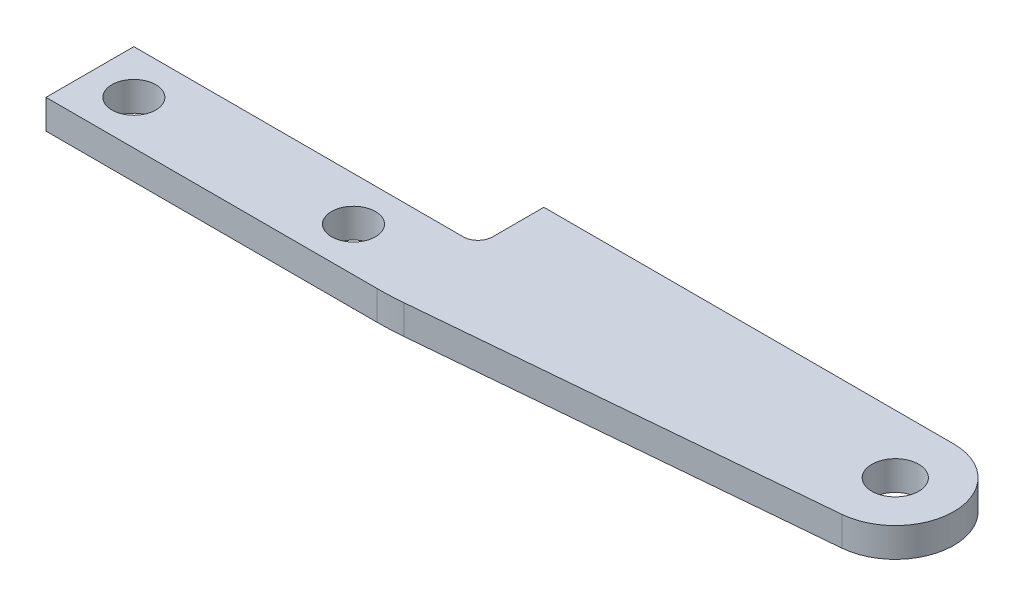
ISO-10303-21;
HEADER;
FILE_DESCRIPTION(('STEP AP214'),'2;1');
FILE_NAME('part.step','',(''),(''),'','','');
FILE_SCHEMA(('AUTOMOTIVE_DESIGN { 1 0 10303 214 1 1 1 1 }'));
ENDSEC;
DATA;
#1=APPLICATION_CONTEXT('core data for automotive mechanical design processes');
#2=APPLICATION_PROTOCOL_DEFINITION('international standard','automotive_design',2000,#1);
#3=PRODUCT_CONTEXT('',#1,'mechanical');
#4=PRODUCT('Part','Part','',(#3));
#5=PRODUCT_RELATED_PRODUCT_CATEGORY('part','',(#4));
#6=PRODUCT_DEFINITION_FORMATION('','',#4);
#7=PRODUCT_DEFINITION_CONTEXT('part definition',#1,'design');
#8=PRODUCT_DEFINITION('design','',#6,#7);
#9=PRODUCT_DEFINITION_SHAPE('','',#8);
#10=(LENGTH_UNIT() NAMED_UNIT(*) SI_UNIT(.MILLI.,.METRE.));
#11=(NAMED_UNIT(*) PLANE_ANGLE_UNIT() SI_UNIT($,.RADIAN.));
#12=(NAMED_UNIT(*) SI_UNIT($,.STERADIAN.) SOLID_ANGLE_UNIT());
#13=UNCERTAINTY_MEASURE_WITH_UNIT(LENGTH_MEASURE(1.E-05),#10,'distance_accuracy_value','');
#14=(GEOMETRIC_REPRESENTATION_CONTEXT(3) GLOBAL_UNCERTAINTY_ASSIGNED_CONTEXT((#13)) GLOBAL_UNIT_ASSIGNED_CONTEXT((#10,
#11,#12)) REPRESENTATION_CONTEXT('',''));
#15=CARTESIAN_POINT('',(0.,0.,0.));
#16=DIRECTION('',(0.,0.,1.));
#17=DIRECTION('',(1.,0.,0.));
#18=AXIS2_PLACEMENT_3D('',#15,#16,#17);
#19=CARTESIAN_POINT('',(48.5,2.,-3.5));
#20=DIRECTION('',(0.,1.,0.));
#21=DIRECTION('',(0.,0.,1.));
#22=AXIS2_PLACEMENT_3D('',#19,#20,#21);
#23=PLANE('',#22);
#24=CARTESIAN_POINT('',(0.,2.,0.));
#25=DIRECTION('',(0.,1.,0.));
#26=DIRECTION('',(0.,0.,-1.));
#27=AXIS2_PLACEMENT_3D('',#24,#25,#26);
#28=CIRCLE('',#27,1.5);
#29=CARTESIAN_POINT('',(0.,2.,-1.5));
#30=VERTEX_POINT('',#29);
#31=EDGE_CURVE('E202',#30,#30,#28,.T.);
#32=ORIENTED_EDGE('',*,*,#31,.F.);
#33=EDGE_LOOP('',(#32));
#34=FACE_BOUND('',#33,.T.);
#35=DIRECTION('',(1.,0.,0.));
#36=VECTOR('',#35,1.);
#37=CARTESIAN_POINT('',(-3.,2.,3.));
#38=LINE('',#37,#36);
#39=CARTESIAN_POINT('',(-3.,2.,3.));
#40=VERTEX_POINT('',#39);
#41=CARTESIAN_POINT('',(19.6144939905132,2.,3.));
#42=VERTEX_POINT('',#41);
#43=EDGE_CURVE('E157',#40,#42,#38,.T.);
#44=ORIENTED_EDGE('',*,*,#43,.T.);
#45=CARTESIAN_POINT('',(19.6144939905132,2.,-17.));
#46=DIRECTION('',(0.,1.,0.));
#47=DIRECTION('',(0.,0.,1.));
#48=AXIS2_PLACEMENT_3D('',#45,#46,#47);
#49=CIRCLE('',#48,20.);
#50=CARTESIAN_POINT('',(21.3820410829761,2.,2.92174132137866));
#51=VERTEX_POINT('',#50);
#52=EDGE_CURVE('E11',#42,#51,#49,.T.);
#53=ORIENTED_EDGE('',*,*,#52,.T.);
#54=DIRECTION('',(0.996087066068933,0.,-0.0883773546231454));
#55=VECTOR('',#54,1.);
#56=CARTESIAN_POINT('',(48.8535094184926,2.,0.484348264275727));
#57=LINE('',#56,#55);
#58=CARTESIAN_POINT('',(48.8535094184926,2.,0.484348264275728));
#59=VERTEX_POINT('',#58);
#60=EDGE_CURVE('E104',#51,#59,#57,.T.);
#61=ORIENTED_EDGE('',*,*,#60,.T.);
#62=CARTESIAN_POINT('',(48.5,2.,-3.5));
#63=DIRECTION('',(0.,1.,0.));
#64=DIRECTION('',(0.,0.,1.));
#65=AXIS2_PLACEMENT_3D('',#62,#63,#64);
#66=CIRCLE('',#65,4.);
#67=CARTESIAN_POINT('',(48.5,2.,-7.5));
#68=VERTEX_POINT('',#67);
#69=EDGE_CURVE('E107',#59,#68,#66,.T.);
#70=ORIENTED_EDGE('',*,*,#69,.T.);
#71=DIRECTION('',(-1.,0.,0.));
#72=VECTOR('',#71,1.);
#73=CARTESIAN_POINT('',(48.5,2.,-7.5));
#74=LINE('',#73,#72);
#75=CARTESIAN_POINT('',(20.5,2.,-7.5));
#76=VERTEX_POINT('',#75);
#77=EDGE_CURVE('E123',#68,#76,#74,.T.);
#78=ORIENTED_EDGE('',*,*,#77,.T.);
#79=DIRECTION('',(0.,0.,1.));
#80=VECTOR('',#79,1.);
#81=CARTESIAN_POINT('',(20.5,2.,-7.5));
#82=LINE('',#81,#80);
#83=CARTESIAN_POINT('',(20.5,2.,-4.));
#84=VERTEX_POINT('',#83);
#85=EDGE_CURVE('E182',#76,#84,#82,.T.);
#86=ORIENTED_EDGE('',*,*,#85,.T.);
#87=CARTESIAN_POINT('',(19.5,2.,-4.));
#88=DIRECTION('',(0.,1.,0.));
#89=DIRECTION('',(0.,0.,1.));
#90=AXIS2_PLACEMENT_3D('',#87,#88,#89);
#91=CIRCLE('',#90,1.);
#92=CARTESIAN_POINT('',(19.5,2.,-3.));
#93=VERTEX_POINT('',#92);
#94=EDGE_CURVE('E140',#84,#93,#91,.F.);
#95=ORIENTED_EDGE('',*,*,#94,.T.);
#96=DIRECTION('',(-1.,0.,0.));
#97=VECTOR('',#96,1.);
#98=CARTESIAN_POINT('',(20.5,2.,-3.));
#99=LINE('',#98,#97);
#100=CARTESIAN_POINT('',(-3.,2.,-3.));
#101=VERTEX_POINT('',#100);
#102=EDGE_CURVE('E194',#93,#101,#99,.T.);
#103=ORIENTED_EDGE('',*,*,#102,.T.);
#104=DIRECTION('',(0.,0.,1.));
#105=VECTOR('',#104,1.);
#106=CARTESIAN_POINT('',(-3.,2.,-3.));
#107=LINE('',#106,#105);
#108=EDGE_CURVE('E196',#101,#40,#107,.T.);
#109=ORIENTED_EDGE('',*,*,#108,.T.);
#110=EDGE_LOOP('',(#44,#53,#61,#70,#78,#86,#95,#103,#109));
#111=FACE_BOUND('',#110,.T.);
#112=CARTESIAN_POINT('',(48.5,2.,-3.5));
#113=DIRECTION('',(0.,1.,0.));
#114=DIRECTION('',(0.,0.,1.));
#115=AXIS2_PLACEMENT_3D('',#112,#113,#114);
#116=CIRCLE('',#115,1.6);
#117=CARTESIAN_POINT('',(48.5,2.,-1.90000000000001));
#118=VERTEX_POINT('',#117);
#119=EDGE_CURVE('E149',#118,#118,#116,.T.);
#120=ORIENTED_EDGE('',*,*,#119,.F.);
#121=EDGE_LOOP('',(#120));
#122=FACE_BOUND('',#121,.T.);
#123=CARTESIAN_POINT('',(15.,2.,0.));
#124=DIRECTION('',(0.,1.,0.));
#125=DIRECTION('',(0.,0.,-1.));
#126=AXIS2_PLACEMENT_3D('',#123,#124,#125);
#127=CIRCLE('',#126,1.5);
#128=CARTESIAN_POINT('',(15.,2.,-1.50000000000001));
#129=VERTEX_POINT('',#128);
#130=EDGE_CURVE('E207',#129,#129,#127,.T.);
#131=ORIENTED_EDGE('',*,*,#130,.F.);
#132=EDGE_LOOP('',(#131));
#133=FACE_BOUND('',#132,.T.);
#134=ADVANCED_FACE('F34',(#34,#111,#122,#133),#23,.T.);
#135=CARTESIAN_POINT('',(48.5,0.,-3.5));
#136=DIRECTION('',(0.,1.,0.));
#137=DIRECTION('',(0.,0.,1.));
#138=AXIS2_PLACEMENT_3D('',#135,#136,#137);
#139=PLANE('',#138);
#140=DIRECTION('',(0.996087066068933,0.,-0.0883773546231454));
#141=VECTOR('',#140,1.);
#142=CARTESIAN_POINT('',(48.8535094184926,0.,0.484348264275727));
#143=LINE('',#142,#141);
#144=CARTESIAN_POINT('',(21.3820410829761,0.,2.92174132137866));
#145=VERTEX_POINT('',#144);
#146=CARTESIAN_POINT('',(48.8535094184926,0.,0.484348264275728));
#147=VERTEX_POINT('',#146);
#148=EDGE_CURVE('E126',#145,#147,#143,.T.);
#149=ORIENTED_EDGE('',*,*,#148,.F.);
#150=CARTESIAN_POINT('',(19.6144939905132,0.,-17.));
#151=DIRECTION('',(0.,1.,0.));
#152=DIRECTION('',(0.,0.,1.));
#153=AXIS2_PLACEMENT_3D('',#150,#151,#152);
#154=CIRCLE('',#153,20.);
#155=CARTESIAN_POINT('',(19.6144939905132,0.,3.));
#156=VERTEX_POINT('',#155);
#157=EDGE_CURVE('E56',#145,#156,#154,.F.);
#158=ORIENTED_EDGE('',*,*,#157,.T.);
#159=DIRECTION('',(1.,0.,0.));
#160=VECTOR('',#159,1.);
#161=CARTESIAN_POINT('',(-3.,0.,3.));
#162=LINE('',#161,#160);
#163=CARTESIAN_POINT('',(-3.,0.,3.));
#164=VERTEX_POINT('',#163);
#165=EDGE_CURVE('E114',#164,#156,#162,.T.);
#166=ORIENTED_EDGE('',*,*,#165,.F.);
#167=DIRECTION('',(0.,0.,1.));
#168=VECTOR('',#167,1.);
#169=CARTESIAN_POINT('',(-3.,0.,-3.));
#170=LINE('',#169,#168);
#171=CARTESIAN_POINT('',(-3.,0.,-3.));
#172=VERTEX_POINT('',#171);
#173=EDGE_CURVE('E166',#172,#164,#170,.T.);
#174=ORIENTED_EDGE('',*,*,#173,.F.);
#175=DIRECTION('',(-1.,0.,0.));
#176=VECTOR('',#175,1.);
#177=CARTESIAN_POINT('',(20.5,0.,-3.));
#178=LINE('',#177,#176);
#179=CARTESIAN_POINT('',(19.5,0.,-3.));
#180=VERTEX_POINT('',#179);
#181=EDGE_CURVE('E164',#180,#172,#178,.T.);
#182=ORIENTED_EDGE('',*,*,#181,.F.);
#183=CARTESIAN_POINT('',(19.5,0.,-4.));
#184=DIRECTION('',(0.,1.,0.));
#185=DIRECTION('',(0.,0.,1.));
#186=AXIS2_PLACEMENT_3D('',#183,#184,#185);
#187=CIRCLE('',#186,1.);
#188=CARTESIAN_POINT('',(20.5,0.,-4.));
#189=VERTEX_POINT('',#188);
#190=EDGE_CURVE('E138',#180,#189,#187,.T.);
#191=ORIENTED_EDGE('',*,*,#190,.T.);
#192=DIRECTION('',(0.,0.,1.));
#193=VECTOR('',#192,1.);
#194=CARTESIAN_POINT('',(20.5,0.,-7.5));
#195=LINE('',#194,#193);
#196=CARTESIAN_POINT('',(20.5,0.,-7.5));
#197=VERTEX_POINT('',#196);
#198=EDGE_CURVE('E161',#197,#189,#195,.T.);
#199=ORIENTED_EDGE('',*,*,#198,.F.);
#200=DIRECTION('',(-1.,0.,0.));
#201=VECTOR('',#200,1.);
#202=CARTESIAN_POINT('',(48.5,0.,-7.5));
#203=LINE('',#202,#201);
#204=CARTESIAN_POINT('',(48.5,0.,-7.5));
#205=VERTEX_POINT('',#204);
#206=EDGE_CURVE('E151',#205,#197,#203,.T.);
#207=ORIENTED_EDGE('',*,*,#206,.F.);
#208=CARTESIAN_POINT('',(48.5,0.,-3.5));
#209=DIRECTION('',(0.,1.,0.));
#210=DIRECTION('',(0.,0.,1.));
#211=AXIS2_PLACEMENT_3D('',#208,#209,#210);
#212=CIRCLE('',#211,4.);
#213=EDGE_CURVE('E148',#147,#205,#212,.T.);
#214=ORIENTED_EDGE('',*,*,#213,.F.);
#215=EDGE_LOOP('',(#149,#158,#166,#174,#182,#191,#199,#207,#214));
#216=FACE_BOUND('',#215,.T.);
#217=CARTESIAN_POINT('',(48.5,0.,-3.5));
#218=DIRECTION('',(0.,1.,0.));
#219=DIRECTION('',(0.,0.,1.));
#220=AXIS2_PLACEMENT_3D('',#217,#218,#219);
#221=CIRCLE('',#220,1.6);
#222=CARTESIAN_POINT('',(48.5,0.,-1.90000000000001));
#223=VERTEX_POINT('',#222);
#224=EDGE_CURVE('E154',#223,#223,#221,.T.);
#225=ORIENTED_EDGE('',*,*,#224,.T.);
#226=EDGE_LOOP('',(#225));
#227=FACE_BOUND('',#226,.T.);
#228=CARTESIAN_POINT('',(0.,0.,0.));
#229=DIRECTION('',(0.,1.,0.));
#230=DIRECTION('',(0.,0.,-1.));
#231=AXIS2_PLACEMENT_3D('',#228,#229,#230);
#232=CIRCLE('',#231,1.5);
#233=CARTESIAN_POINT('',(0.,0.,-1.5));
#234=VERTEX_POINT('',#233);
#235=EDGE_CURVE('E204',#234,#234,#232,.T.);
#236=ORIENTED_EDGE('',*,*,#235,.T.);
#237=EDGE_LOOP('',(#236));
#238=FACE_BOUND('',#237,.T.);
#239=CARTESIAN_POINT('',(15.,0.,0.));
#240=DIRECTION('',(0.,1.,0.));
#241=DIRECTION('',(0.,0.,-1.));
#242=AXIS2_PLACEMENT_3D('',#239,#240,#241);
#243=CIRCLE('',#242,1.5);
#244=CARTESIAN_POINT('',(15.,0.,-1.50000000000001));
#245=VERTEX_POINT('',#244);
#246=EDGE_CURVE('E210',#245,#245,#243,.T.);
#247=ORIENTED_EDGE('',*,*,#246,.T.);
#248=EDGE_LOOP('',(#247));
#249=FACE_BOUND('',#248,.T.);
#250=ADVANCED_FACE('F145',(#216,#227,#238,#249),#139,.F.);
#251=CARTESIAN_POINT('',(48.8535094184926,2.,0.484348264275727));
#252=DIRECTION('',(-0.0883773546231454,0.,-0.996087066068933));
#253=DIRECTION('',(-0.996087066068933,0.,0.0883773546231454));
#254=AXIS2_PLACEMENT_3D('',#251,#252,#253);
#255=PLANE('',#254);
#256=ORIENTED_EDGE('',*,*,#60,.F.);
#257=DIRECTION('',(0.,-1.,0.));
#258=VECTOR('',#257,1.);
#259=CARTESIAN_POINT('',(21.3820410829761,2.,2.92174132137866));
#260=LINE('',#259,#258);
#261=EDGE_CURVE('E142',#51,#145,#260,.T.);
#262=ORIENTED_EDGE('',*,*,#261,.T.);
#263=ORIENTED_EDGE('',*,*,#148,.T.);
#264=DIRECTION('',(0.,-1.,0.));
#265=VECTOR('',#264,1.);
#266=CARTESIAN_POINT('',(48.8535094184926,2.,0.484348264275728));
#267=LINE('',#266,#265);
#268=EDGE_CURVE('E119',#59,#147,#267,.T.);
#269=ORIENTED_EDGE('',*,*,#268,.F.);
#270=EDGE_LOOP('',(#256,#262,#263,#269));
#271=FACE_BOUND('',#270,.T.);
#272=ADVANCED_FACE('F125',(#271),#255,.F.);
#273=CARTESIAN_POINT('',(48.5,2.,-3.5));
#274=DIRECTION('',(0.,-1.,0.));
#275=DIRECTION('',(0.,0.,-1.));
#276=AXIS2_PLACEMENT_3D('',#273,#274,#275);
#277=CYLINDRICAL_SURFACE('',#276,4.);
#278=ORIENTED_EDGE('',*,*,#213,.T.);
#279=DIRECTION('',(0.,-1.,0.));
#280=VECTOR('',#279,1.);
#281=CARTESIAN_POINT('',(48.5,2.,-7.5));
#282=LINE('',#281,#280);
#283=EDGE_CURVE('E121',#68,#205,#282,.T.);
#284=ORIENTED_EDGE('',*,*,#283,.F.);
#285=ORIENTED_EDGE('',*,*,#69,.F.);
#286=ORIENTED_EDGE('',*,*,#268,.T.);
#287=EDGE_LOOP('',(#278,#284,#285,#286));
#288=FACE_BOUND('',#287,.T.);
#289=ADVANCED_FACE('F118',(#288),#277,.T.);
#290=CARTESIAN_POINT('',(48.5,2.,-7.5));
#291=DIRECTION('',(0.,0.,1.));
#292=DIRECTION('',(1.,0.,0.));
#293=AXIS2_PLACEMENT_3D('',#290,#291,#292);
#294=PLANE('',#293);
#295=ORIENTED_EDGE('',*,*,#206,.T.);
#296=DIRECTION('',(0.,-1.,0.));
#297=VECTOR('',#296,1.);
#298=CARTESIAN_POINT('',(20.5,2.,-7.5));
#299=LINE('',#298,#297);
#300=EDGE_CURVE('E133',#76,#197,#299,.T.);
#301=ORIENTED_EDGE('',*,*,#300,.F.);
#302=ORIENTED_EDGE('',*,*,#77,.F.);
#303=ORIENTED_EDGE('',*,*,#283,.T.);
#304=EDGE_LOOP('',(#295,#301,#302,#303));
#305=FACE_BOUND('',#304,.T.);
#306=ADVANCED_FACE('F242',(#305),#294,.F.);
#307=CARTESIAN_POINT('',(20.5,2.,-7.5));
#308=DIRECTION('',(1.,0.,0.));
#309=DIRECTION('',(0.,0.,-1.));
#310=AXIS2_PLACEMENT_3D('',#307,#308,#309);
#311=PLANE('',#310);
#312=ORIENTED_EDGE('',*,*,#198,.T.);
#313=DIRECTION('',(0.,-1.,0.));
#314=VECTOR('',#313,1.);
#315=CARTESIAN_POINT('',(20.5,2.,-4.));
#316=LINE('',#315,#314);
#317=EDGE_CURVE('E131',#189,#84,#316,.F.);
#318=ORIENTED_EDGE('',*,*,#317,.T.);
#319=ORIENTED_EDGE('',*,*,#85,.F.);
#320=ORIENTED_EDGE('',*,*,#300,.T.);
#321=EDGE_LOOP('',(#312,#318,#319,#320));
#322=FACE_BOUND('',#321,.T.);
#323=ADVANCED_FACE('F179',(#322),#311,.F.);
#324=CARTESIAN_POINT('',(20.5,2.,-3.));
#325=DIRECTION('',(0.,0.,1.));
#326=DIRECTION('',(1.,0.,0.));
#327=AXIS2_PLACEMENT_3D('',#324,#325,#326);
#328=PLANE('',#327);
#329=ORIENTED_EDGE('',*,*,#102,.F.);
#330=DIRECTION('',(0.,-1.,0.));
#331=VECTOR('',#330,1.);
#332=CARTESIAN_POINT('',(19.5,0.,-3.));
#333=LINE('',#332,#331);
#334=EDGE_CURVE('E128',#93,#180,#333,.T.);
#335=ORIENTED_EDGE('',*,*,#334,.T.);
#336=ORIENTED_EDGE('',*,*,#181,.T.);
#337=DIRECTION('',(0.,-1.,0.));
#338=VECTOR('',#337,1.);
#339=CARTESIAN_POINT('',(-3.,2.,-3.));
#340=LINE('',#339,#338);
#341=EDGE_CURVE('E172',#101,#172,#340,.T.);
#342=ORIENTED_EDGE('',*,*,#341,.F.);
#343=EDGE_LOOP('',(#329,#335,#336,#342));
#344=FACE_BOUND('',#343,.T.);
#345=ADVANCED_FACE('F192',(#344),#328,.F.);
#346=CARTESIAN_POINT('',(-3.,2.,-3.));
#347=DIRECTION('',(1.,0.,0.));
#348=DIRECTION('',(0.,0.,-1.));
#349=AXIS2_PLACEMENT_3D('',#346,#347,#348);
#350=PLANE('',#349);
#351=ORIENTED_EDGE('',*,*,#173,.T.);
#352=DIRECTION('',(0.,-1.,0.));
#353=VECTOR('',#352,1.);
#354=CARTESIAN_POINT('',(-3.,2.,3.));
#355=LINE('',#354,#353);
#356=EDGE_CURVE('E169',#40,#164,#355,.T.);
#357=ORIENTED_EDGE('',*,*,#356,.F.);
#358=ORIENTED_EDGE('',*,*,#108,.F.);
#359=ORIENTED_EDGE('',*,*,#341,.T.);
#360=EDGE_LOOP('',(#351,#357,#358,#359));
#361=FACE_BOUND('',#360,.T.);
#362=ADVANCED_FACE('F234',(#361),#350,.F.);
#363=CARTESIAN_POINT('',(-3.,2.,3.));
#364=DIRECTION('',(0.,0.,-1.));
#365=DIRECTION('',(-1.,0.,0.));
#366=AXIS2_PLACEMENT_3D('',#363,#364,#365);
#367=PLANE('',#366);
#368=ORIENTED_EDGE('',*,*,#165,.T.);
#369=DIRECTION('',(0.,-1.,0.));
#370=VECTOR('',#369,1.);
#371=CARTESIAN_POINT('',(19.6144939905132,2.,3.));
#372=LINE('',#371,#370);
#373=EDGE_CURVE('E42',#156,#42,#372,.F.);
#374=ORIENTED_EDGE('',*,*,#373,.T.);
#375=ORIENTED_EDGE('',*,*,#43,.F.);
#376=ORIENTED_EDGE('',*,*,#356,.T.);
#377=EDGE_LOOP('',(#368,#374,#375,#376));
#378=FACE_BOUND('',#377,.T.);
#379=ADVANCED_FACE('F231',(#378),#367,.F.);
#380=CARTESIAN_POINT('',(48.5,2.,-3.5));
#381=DIRECTION('',(0.,-1.,0.));
#382=DIRECTION('',(0.,0.,-1.));
#383=AXIS2_PLACEMENT_3D('',#380,#381,#382);
#384=CYLINDRICAL_SURFACE('',#383,1.6);
#385=ORIENTED_EDGE('',*,*,#119,.T.);
#386=EDGE_LOOP('',(#385));
#387=FACE_BOUND('',#386,.T.);
#388=ORIENTED_EDGE('',*,*,#224,.F.);
#389=EDGE_LOOP('',(#388));
#390=FACE_BOUND('',#389,.T.);
#391=ADVANCED_FACE('F228',(#387,#390),#384,.F.);
#392=CARTESIAN_POINT('',(0.,2.,0.));
#393=DIRECTION('',(0.,-1.,0.));
#394=DIRECTION('',(0.,0.,-1.));
#395=AXIS2_PLACEMENT_3D('',#392,#393,#394);
#396=CYLINDRICAL_SURFACE('',#395,1.5);
#397=ORIENTED_EDGE('',*,*,#31,.T.);
#398=EDGE_LOOP('',(#397));
#399=FACE_BOUND('',#398,.T.);
#400=ORIENTED_EDGE('',*,*,#235,.F.);
#401=EDGE_LOOP('',(#400));
#402=FACE_BOUND('',#401,.T.);
#403=ADVANCED_FACE('F253',(#399,#402),#396,.F.);
#404=CARTESIAN_POINT('',(15.,2.,0.));
#405=DIRECTION('',(0.,-1.,0.));
#406=DIRECTION('',(0.,0.,-1.));
#407=AXIS2_PLACEMENT_3D('',#404,#405,#406);
#408=CYLINDRICAL_SURFACE('',#407,1.5);
#409=ORIENTED_EDGE('',*,*,#130,.T.);
#410=EDGE_LOOP('',(#409));
#411=FACE_BOUND('',#410,.T.);
#412=ORIENTED_EDGE('',*,*,#246,.F.);
#413=EDGE_LOOP('',(#412));
#414=FACE_BOUND('',#413,.T.);
#415=ADVANCED_FACE('F216',(#411,#414),#408,.F.);
#416=CARTESIAN_POINT('',(19.5,2.,-4.));
#417=DIRECTION('',(0.,1.,0.));
#418=DIRECTION('',(0.,0.,1.));
#419=AXIS2_PLACEMENT_3D('',#416,#417,#418);
#420=CYLINDRICAL_SURFACE('',#419,1.);
#421=ORIENTED_EDGE('',*,*,#94,.F.);
#422=ORIENTED_EDGE('',*,*,#317,.F.);
#423=ORIENTED_EDGE('',*,*,#190,.F.);
#424=ORIENTED_EDGE('',*,*,#334,.F.);
#425=EDGE_LOOP('',(#421,#422,#423,#424));
#426=FACE_BOUND('',#425,.T.);
#427=ADVANCED_FACE('F189',(#426),#420,.F.);
#428=CARTESIAN_POINT('',(19.6144939905132,2.,-17.));
#429=DIRECTION('',(0.,-1.,0.));
#430=DIRECTION('',(0.,0.,-1.));
#431=AXIS2_PLACEMENT_3D('',#428,#429,#430);
#432=CYLINDRICAL_SURFACE('',#431,20.);
#433=ORIENTED_EDGE('',*,*,#52,.F.);
#434=ORIENTED_EDGE('',*,*,#373,.F.);
#435=ORIENTED_EDGE('',*,*,#157,.F.);
#436=ORIENTED_EDGE('',*,*,#261,.F.);
#437=EDGE_LOOP('',(#433,#434,#435,#436));
#438=FACE_BOUND('',#437,.T.);
#439=ADVANCED_FACE('F36',(#438),#432,.T.);
#440=CLOSED_SHELL('',(#134,#250,#272,#289,#306,#323,#345,#362,#379,#391,#403,#415,#427,#439));
#441=MANIFOLD_SOLID_BREP('B2',#440);
#442=ADVANCED_BREP_SHAPE_REPRESENTATION('',(#18,#441),#14);
#443=SHAPE_DEFINITION_REPRESENTATION(#9,#442);
ENDSEC;
END-ISO-10303-21;
